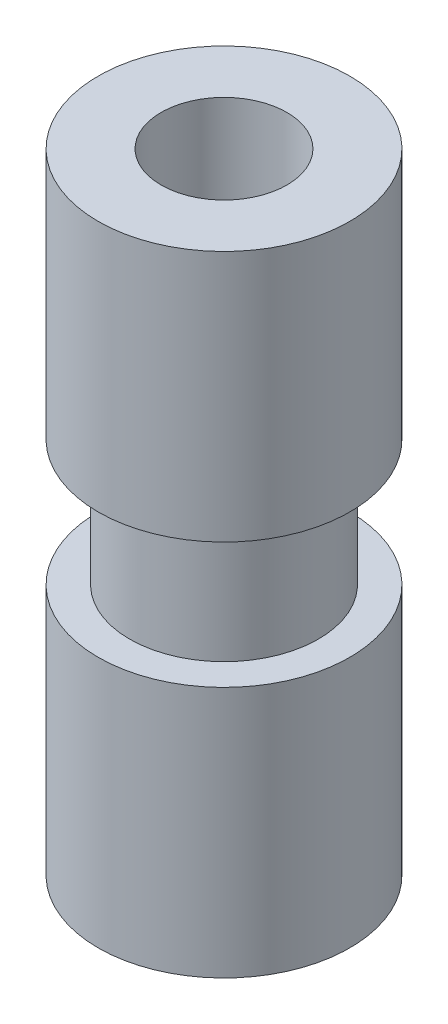
ISO-10303-21;
HEADER;
FILE_DESCRIPTION(('STEP AP214'),'2;1');
FILE_NAME('part.step','',(''),(''),'','','');
FILE_SCHEMA(('AUTOMOTIVE_DESIGN { 1 0 10303 214 1 1 1 1 }'));
ENDSEC;
DATA;
#1=APPLICATION_CONTEXT('core data for automotive mechanical design processes');
#2=APPLICATION_PROTOCOL_DEFINITION('international standard','automotive_design',2000,#1);
#3=PRODUCT_CONTEXT('',#1,'mechanical');
#4=PRODUCT('Part','Part','',(#3));
#5=PRODUCT_RELATED_PRODUCT_CATEGORY('part','',(#4));
#6=PRODUCT_DEFINITION_FORMATION('','',#4);
#7=PRODUCT_DEFINITION_CONTEXT('part definition',#1,'design');
#8=PRODUCT_DEFINITION('design','',#6,#7);
#9=PRODUCT_DEFINITION_SHAPE('','',#8);
#10=(LENGTH_UNIT() NAMED_UNIT(*) SI_UNIT(.MILLI.,.METRE.));
#11=(NAMED_UNIT(*) PLANE_ANGLE_UNIT() SI_UNIT($,.RADIAN.));
#12=(NAMED_UNIT(*) SI_UNIT($,.STERADIAN.) SOLID_ANGLE_UNIT());
#13=UNCERTAINTY_MEASURE_WITH_UNIT(LENGTH_MEASURE(1.E-05),#10,'distance_accuracy_value','');
#14=(GEOMETRIC_REPRESENTATION_CONTEXT(3) GLOBAL_UNCERTAINTY_ASSIGNED_CONTEXT((#13)) GLOBAL_UNIT_ASSIGNED_CONTEXT((#10,
#11,#12)) REPRESENTATION_CONTEXT('',''));
#15=CARTESIAN_POINT('',(0.,0.,0.));
#16=DIRECTION('',(0.,0.,1.));
#17=DIRECTION('',(1.,0.,0.));
#18=AXIS2_PLACEMENT_3D('',#15,#16,#17);
#19=CARTESIAN_POINT('',(0.,-4.,0.));
#20=DIRECTION('',(0.,1.,0.));
#21=DIRECTION('',(0.,0.,1.));
#22=AXIS2_PLACEMENT_3D('',#19,#20,#21);
#23=CYLINDRICAL_SURFACE('',#22,2.);
#24=CARTESIAN_POINT('',(0.,-4.,0.));
#25=DIRECTION('',(0.,1.,0.));
#26=DIRECTION('',(0.,0.,1.));
#27=AXIS2_PLACEMENT_3D('',#24,#25,#26);
#28=CIRCLE('',#27,2.);
#29=CARTESIAN_POINT('',(0.,-4.,2.));
#30=VERTEX_POINT('',#29);
#31=EDGE_CURVE('E10',#30,#30,#28,.T.);
#32=ORIENTED_EDGE('',*,*,#31,.T.);
#33=EDGE_LOOP('',(#32));
#34=FACE_BOUND('',#33,.T.);
#35=CARTESIAN_POINT('',(0.,0.,0.));
#36=DIRECTION('',(0.,1.,0.));
#37=DIRECTION('',(0.,0.,1.));
#38=AXIS2_PLACEMENT_3D('',#35,#36,#37);
#39=CIRCLE('',#38,2.);
#40=CARTESIAN_POINT('',(0.,0.,2.));
#41=VERTEX_POINT('',#40);
#42=EDGE_CURVE('E55',#41,#41,#39,.T.);
#43=ORIENTED_EDGE('',*,*,#42,.F.);
#44=EDGE_LOOP('',(#43));
#45=FACE_BOUND('',#44,.T.);
#46=ADVANCED_FACE('F34',(#34,#45),#23,.T.);
#47=CARTESIAN_POINT('',(0.,2.,0.));
#48=DIRECTION('',(0.,1.,0.));
#49=DIRECTION('',(0.,0.,1.));
#50=AXIS2_PLACEMENT_3D('',#47,#48,#49);
#51=CIRCLE('',#50,2.);
#52=CARTESIAN_POINT('',(0.,2.,2.));
#53=VERTEX_POINT('',#52);
#54=EDGE_CURVE('E54',#53,#53,#51,.T.);
#55=ORIENTED_EDGE('',*,*,#54,.T.);
#56=EDGE_LOOP('',(#55));
#57=FACE_BOUND('',#56,.T.);
#58=CARTESIAN_POINT('',(0.,6.,0.));
#59=DIRECTION('',(0.,1.,0.));
#60=DIRECTION('',(0.,0.,1.));
#61=AXIS2_PLACEMENT_3D('',#58,#59,#60);
#62=CIRCLE('',#61,2.);
#63=CARTESIAN_POINT('',(0.,6.,2.));
#64=VERTEX_POINT('',#63);
#65=EDGE_CURVE('E45',#64,#64,#62,.T.);
#66=ORIENTED_EDGE('',*,*,#65,.F.);
#67=EDGE_LOOP('',(#66));
#68=FACE_BOUND('',#67,.T.);
#69=ADVANCED_FACE('F36',(#57,#68),#23,.T.);
#70=CARTESIAN_POINT('',(0.,-4.,0.));
#71=DIRECTION('',(0.,1.,0.));
#72=DIRECTION('',(0.,0.,1.));
#73=AXIS2_PLACEMENT_3D('',#70,#71,#72);
#74=PLANE('',#73);
#75=CARTESIAN_POINT('',(0.,-4.,0.));
#76=DIRECTION('',(0.,1.,0.));
#77=DIRECTION('',(0.,0.,1.));
#78=AXIS2_PLACEMENT_3D('',#75,#76,#77);
#79=CIRCLE('',#78,1.);
#80=CARTESIAN_POINT('',(0.,-4.,1.));
#81=VERTEX_POINT('',#80);
#82=EDGE_CURVE('E41',#81,#81,#79,.T.);
#83=ORIENTED_EDGE('',*,*,#82,.T.);
#84=EDGE_LOOP('',(#83));
#85=FACE_BOUND('',#84,.T.);
#86=ORIENTED_EDGE('',*,*,#31,.F.);
#87=EDGE_LOOP('',(#86));
#88=FACE_BOUND('',#87,.T.);
#89=ADVANCED_FACE('F90',(#85,#88),#74,.F.);
#90=CARTESIAN_POINT('',(0.,-4.,0.));
#91=DIRECTION('',(0.,1.,0.));
#92=DIRECTION('',(0.,0.,1.));
#93=AXIS2_PLACEMENT_3D('',#90,#91,#92);
#94=CYLINDRICAL_SURFACE('',#93,1.);
#95=ORIENTED_EDGE('',*,*,#82,.F.);
#96=EDGE_LOOP('',(#95));
#97=FACE_BOUND('',#96,.T.);
#98=CARTESIAN_POINT('',(0.,6.,0.));
#99=DIRECTION('',(0.,1.,0.));
#100=DIRECTION('',(0.,0.,1.));
#101=AXIS2_PLACEMENT_3D('',#98,#99,#100);
#102=CIRCLE('',#101,1.);
#103=CARTESIAN_POINT('',(0.,6.,1.));
#104=VERTEX_POINT('',#103);
#105=EDGE_CURVE('E49',#104,#104,#102,.T.);
#106=ORIENTED_EDGE('',*,*,#105,.T.);
#107=EDGE_LOOP('',(#106));
#108=FACE_BOUND('',#107,.T.);
#109=ADVANCED_FACE('F97',(#97,#108),#94,.F.);
#110=CARTESIAN_POINT('',(0.,6.,0.));
#111=DIRECTION('',(0.,1.,0.));
#112=DIRECTION('',(0.,0.,1.));
#113=AXIS2_PLACEMENT_3D('',#110,#111,#112);
#114=PLANE('',#113);
#115=ORIENTED_EDGE('',*,*,#65,.T.);
#116=EDGE_LOOP('',(#115));
#117=FACE_BOUND('',#116,.T.);
#118=ORIENTED_EDGE('',*,*,#105,.F.);
#119=EDGE_LOOP('',(#118));
#120=FACE_BOUND('',#119,.T.);
#121=ADVANCED_FACE('F82',(#117,#120),#114,.T.);
#122=CARTESIAN_POINT('',(0.,2.,0.));
#123=DIRECTION('',(0.,1.,0.));
#124=DIRECTION('',(0.,0.,1.));
#125=AXIS2_PLACEMENT_3D('',#122,#123,#124);
#126=PLANE('',#125);
#127=ORIENTED_EDGE('',*,*,#54,.F.);
#128=EDGE_LOOP('',(#127));
#129=FACE_BOUND('',#128,.T.);
#130=CARTESIAN_POINT('',(0.,2.,0.));
#131=DIRECTION('',(0.,1.,0.));
#132=DIRECTION('',(0.,0.,1.));
#133=AXIS2_PLACEMENT_3D('',#130,#131,#132);
#134=CIRCLE('',#133,1.5);
#135=CARTESIAN_POINT('',(0.,2.,1.5));
#136=VERTEX_POINT('',#135);
#137=EDGE_CURVE('E58',#136,#136,#134,.T.);
#138=ORIENTED_EDGE('',*,*,#137,.T.);
#139=EDGE_LOOP('',(#138));
#140=FACE_BOUND('',#139,.T.);
#141=ADVANCED_FACE('F67',(#129,#140),#126,.F.);
#142=CARTESIAN_POINT('',(0.,0.,0.));
#143=DIRECTION('',(0.,1.,0.));
#144=DIRECTION('',(0.,0.,1.));
#145=AXIS2_PLACEMENT_3D('',#142,#143,#144);
#146=PLANE('',#145);
#147=ORIENTED_EDGE('',*,*,#42,.T.);
#148=EDGE_LOOP('',(#147));
#149=FACE_BOUND('',#148,.T.);
#150=CARTESIAN_POINT('',(0.,0.,0.));
#151=DIRECTION('',(0.,1.,0.));
#152=DIRECTION('',(0.,0.,1.));
#153=AXIS2_PLACEMENT_3D('',#150,#151,#152);
#154=CIRCLE('',#153,1.5);
#155=CARTESIAN_POINT('',(0.,0.,1.5));
#156=VERTEX_POINT('',#155);
#157=EDGE_CURVE('E61',#156,#156,#154,.T.);
#158=ORIENTED_EDGE('',*,*,#157,.F.);
#159=EDGE_LOOP('',(#158));
#160=FACE_BOUND('',#159,.T.);
#161=ADVANCED_FACE('F72',(#149,#160),#146,.T.);
#162=CARTESIAN_POINT('',(0.,2.,0.));
#163=DIRECTION('',(0.,-1.,0.));
#164=DIRECTION('',(0.,0.,-1.));
#165=AXIS2_PLACEMENT_3D('',#162,#163,#164);
#166=CYLINDRICAL_SURFACE('',#165,1.5);
#167=ORIENTED_EDGE('',*,*,#137,.F.);
#168=EDGE_LOOP('',(#167));
#169=FACE_BOUND('',#168,.T.);
#170=ORIENTED_EDGE('',*,*,#157,.T.);
#171=EDGE_LOOP('',(#170));
#172=FACE_BOUND('',#171,.T.);
#173=ADVANCED_FACE('F69',(#169,#172),#166,.T.);
#174=CLOSED_SHELL('',(#46,#69,#89,#109,#121,#141,#161,#173));
#175=MANIFOLD_SOLID_BREP('B2',#174);
#176=ADVANCED_BREP_SHAPE_REPRESENTATION('',(#18,#175),#14);
#177=SHAPE_DEFINITION_REPRESENTATION(#9,#176);
ENDSEC;
END-ISO-10303-21;
